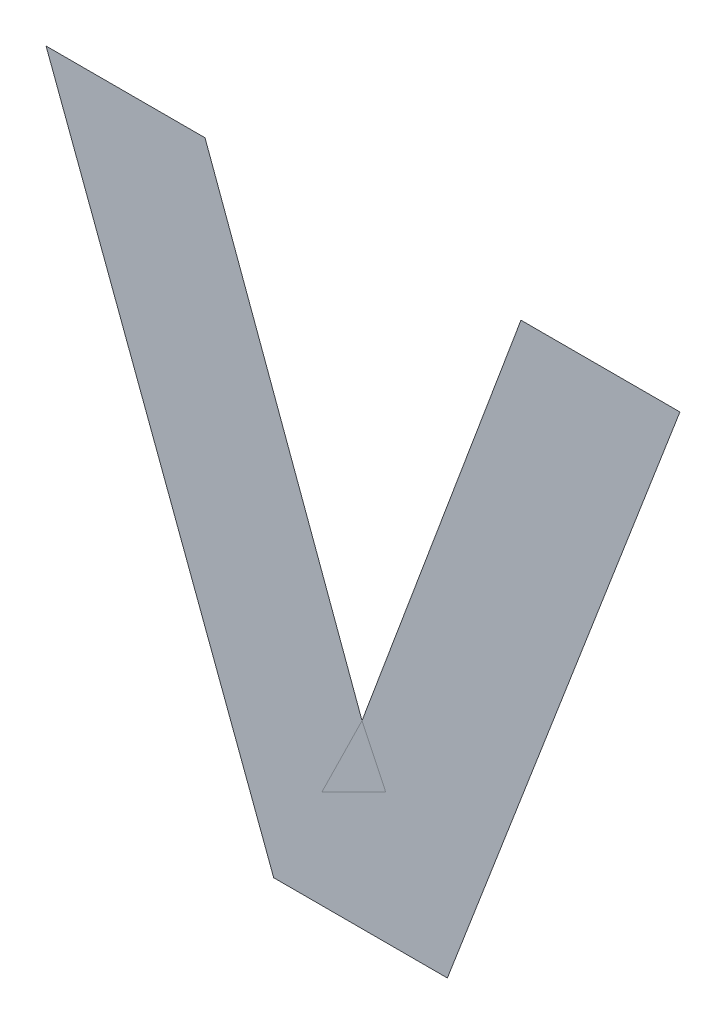
ISO-10303-21;
HEADER;
FILE_DESCRIPTION(('STEP AP214'),'2;1');
FILE_NAME('part.step','',(''),(''),'','','');
FILE_SCHEMA(('AUTOMOTIVE_DESIGN { 1 0 10303 214 1 1 1 1 }'));
ENDSEC;
DATA;
#1=APPLICATION_CONTEXT('core data for automotive mechanical design processes');
#2=APPLICATION_PROTOCOL_DEFINITION('international standard','automotive_design',2000,#1);
#3=PRODUCT_CONTEXT('',#1,'mechanical');
#4=PRODUCT('Part','Part','',(#3));
#5=PRODUCT_RELATED_PRODUCT_CATEGORY('part','',(#4));
#6=PRODUCT_DEFINITION_FORMATION('','',#4);
#7=PRODUCT_DEFINITION_CONTEXT('part definition',#1,'design');
#8=PRODUCT_DEFINITION('design','',#6,#7);
#9=PRODUCT_DEFINITION_SHAPE('','',#8);
#10=(LENGTH_UNIT() NAMED_UNIT(*) SI_UNIT(.MILLI.,.METRE.));
#11=(NAMED_UNIT(*) PLANE_ANGLE_UNIT() SI_UNIT($,.RADIAN.));
#12=(NAMED_UNIT(*) SI_UNIT($,.STERADIAN.) SOLID_ANGLE_UNIT());
#13=UNCERTAINTY_MEASURE_WITH_UNIT(LENGTH_MEASURE(1.E-05),#10,'distance_accuracy_value','');
#14=(GEOMETRIC_REPRESENTATION_CONTEXT(3) GLOBAL_UNCERTAINTY_ASSIGNED_CONTEXT((#13)) GLOBAL_UNIT_ASSIGNED_CONTEXT((#10,
#11,#12)) REPRESENTATION_CONTEXT('',''));
#15=CARTESIAN_POINT('',(0.,0.,0.));
#16=DIRECTION('',(0.,0.,1.));
#17=DIRECTION('',(1.,0.,0.));
#18=AXIS2_PLACEMENT_3D('',#15,#16,#17);
#19=CARTESIAN_POINT('',(-0.220457650024,0.773280378382,0.00045));
#20=DIRECTION('',(0.,0.,1.));
#21=DIRECTION('',(1.,0.,0.));
#22=AXIS2_PLACEMENT_3D('',#19,#20,#21);
#23=PLANE('',#22);
#24=CARTESIAN_POINT('',(-0.240983602749,0.852070542747,0.00045));
#25=DIRECTION('',(-1.,0.,0.));
#26=VECTOR('',#25,1.);
#27=LINE('',#24,#26);
#28=CARTESIAN_POINT('',(-0.240983602749,0.852070542747,0.000225));
#29=VERTEX_POINT('',#28);
#30=CARTESIAN_POINT('',(-0.261629427599,0.852070542747,0.000225));
#31=VERTEX_POINT('',#30);
#32=EDGE_CURVE('E127',#29,#31,#27,.T.);
#33=ORIENTED_EDGE('',*,*,#32,.T.);
#34=CARTESIAN_POINT('',(-0.261629427599,0.852070542747,0.00045));
#35=DIRECTION('',(0.351380067418283,-0.936232902765718,0.));
#36=VECTOR('',#35,1.);
#37=LINE('',#34,#36);
#38=CARTESIAN_POINT('',(-0.232058480899,0.773280378382,0.000225));
#39=VERTEX_POINT('',#38);
#40=EDGE_CURVE('E28',#31,#39,#37,.T.);
#41=ORIENTED_EDGE('',*,*,#40,.T.);
#42=CARTESIAN_POINT('',(-0.232058480899,0.773280378382,0.00045));
#43=DIRECTION('',(1.,0.,0.));
#44=VECTOR('',#43,1.);
#45=LINE('',#42,#44);
#46=CARTESIAN_POINT('',(-0.209498829549,0.773280378382,0.000225));
#47=VERTEX_POINT('',#46);
#48=EDGE_CURVE('E11',#39,#47,#45,.T.);
#49=ORIENTED_EDGE('',*,*,#48,.T.);
#50=CARTESIAN_POINT('',(-0.209498829549,0.773280378382,0.00045));
#51=DIRECTION('',(0.358039959936834,0.93370626381557,0.));
#52=VECTOR('',#51,1.);
#53=LINE('',#50,#52);
#54=CARTESIAN_POINT('',(-0.179285872449,0.852070542747,0.000225));
#55=VERTEX_POINT('',#54);
#56=EDGE_CURVE('E53',#47,#55,#53,.T.);
#57=ORIENTED_EDGE('',*,*,#56,.T.);
#58=CARTESIAN_POINT('',(-0.179285872449,0.852070542747,0.00045));
#59=DIRECTION('',(-1.,0.,0.));
#60=VECTOR('',#59,1.);
#61=LINE('',#58,#60);
#62=CARTESIAN_POINT('',(-0.199937793299,0.852070542747,0.000225));
#63=VERTEX_POINT('',#62);
#64=EDGE_CURVE('E50',#55,#63,#61,.T.);
#65=ORIENTED_EDGE('',*,*,#64,.T.);
#66=CARTESIAN_POINT('',(-0.199937793299,0.852070542747,0.00045));
#67=DIRECTION('',(-0.347456646230637,-0.937696048296119,0.));
#68=VECTOR('',#67,1.);
#69=LINE('',#66,#68);
#70=CARTESIAN_POINT('',(-0.220586662974,0.796687239112,0.000225));
#71=VERTEX_POINT('',#70);
#72=EDGE_CURVE('E125',#63,#71,#69,.T.);
#73=ORIENTED_EDGE('',*,*,#72,.T.);
#74=CARTESIAN_POINT('',(-0.220713640749,0.796687239112,0.00045));
#75=DIRECTION('',(-0.343697840030351,0.939080291965746,0.));
#76=VECTOR('',#75,1.);
#77=LINE('',#74,#76);
#78=EDGE_CURVE('E126',#71,#29,#77,.T.);
#79=ORIENTED_EDGE('',*,*,#78,.T.);
#80=EDGE_LOOP('',(#33,#41,#49,#57,#65,#73,#79));
#81=FACE_BOUND('',#80,.T.);
#82=ADVANCED_FACE('F17',(#81),#23,.T.);
#83=CARTESIAN_POINT('',(-0.220457650024,0.773280378382,0.));
#84=DIRECTION('',(0.,0.,1.));
#85=DIRECTION('',(1.,0.,0.));
#86=AXIS2_PLACEMENT_3D('',#83,#84,#85);
#87=PLANE('',#86);
#88=ORIENTED_EDGE('',*,*,#40,.F.);
#89=ORIENTED_EDGE('',*,*,#32,.F.);
#90=ORIENTED_EDGE('',*,*,#78,.F.);
#91=ORIENTED_EDGE('',*,*,#72,.F.);
#92=ORIENTED_EDGE('',*,*,#64,.F.);
#93=ORIENTED_EDGE('',*,*,#56,.F.);
#94=ORIENTED_EDGE('',*,*,#48,.F.);
#95=EDGE_LOOP('',(#88,#89,#90,#91,#92,#93,#94));
#96=FACE_BOUND('',#95,.T.);
#97=ADVANCED_FACE('F55',(#96),#87,.F.);
#98=CLOSED_SHELL('',(#82,#97));
#99=MANIFOLD_SOLID_BREP('B1',#98);
#100=ADVANCED_BREP_SHAPE_REPRESENTATION('',(#18,#99),#14);
#101=SHAPE_DEFINITION_REPRESENTATION(#9,#100);
ENDSEC;
END-ISO-10303-21;
